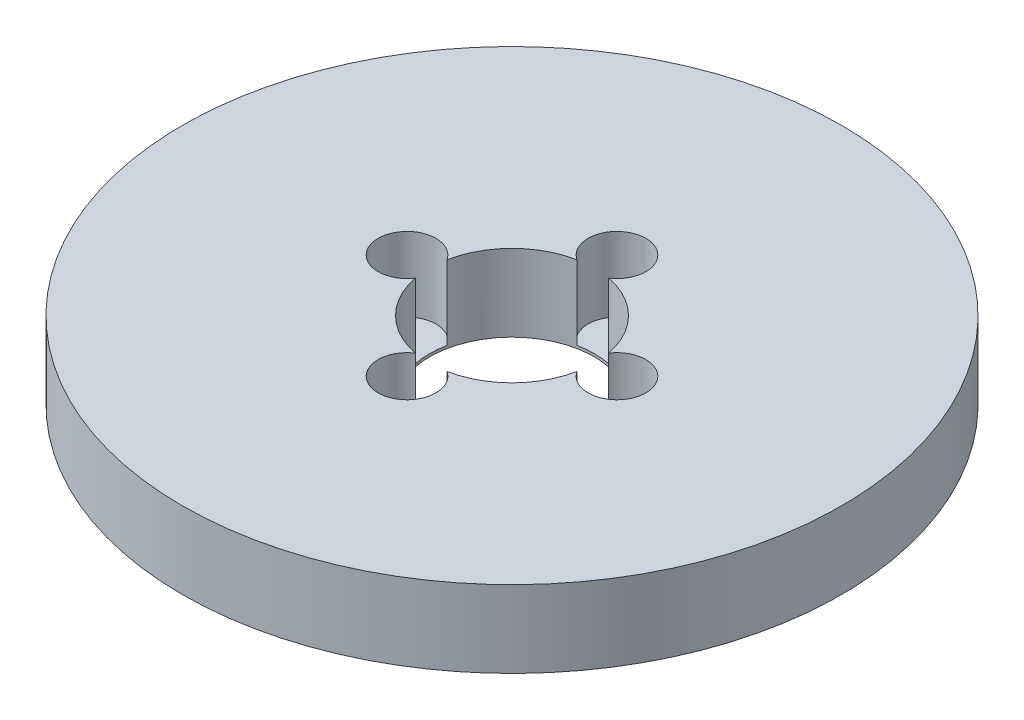
ISO-10303-21;
HEADER;
FILE_DESCRIPTION(('STEP AP214'),'2;1');
FILE_NAME('part.step','',(''),(''),'','','');
FILE_SCHEMA(('AUTOMOTIVE_DESIGN { 1 0 10303 214 1 1 1 1 }'));
ENDSEC;
DATA;
#1=APPLICATION_CONTEXT('core data for automotive mechanical design processes');
#2=APPLICATION_PROTOCOL_DEFINITION('international standard','automotive_design',2000,#1);
#3=PRODUCT_CONTEXT('',#1,'mechanical');
#4=PRODUCT('Part','Part','',(#3));
#5=PRODUCT_RELATED_PRODUCT_CATEGORY('part','',(#4));
#6=PRODUCT_DEFINITION_FORMATION('','',#4);
#7=PRODUCT_DEFINITION_CONTEXT('part definition',#1,'design');
#8=PRODUCT_DEFINITION('design','',#6,#7);
#9=PRODUCT_DEFINITION_SHAPE('','',#8);
#10=(LENGTH_UNIT() NAMED_UNIT(*) SI_UNIT(.MILLI.,.METRE.));
#11=(NAMED_UNIT(*) PLANE_ANGLE_UNIT() SI_UNIT($,.RADIAN.));
#12=(NAMED_UNIT(*) SI_UNIT($,.STERADIAN.) SOLID_ANGLE_UNIT());
#13=UNCERTAINTY_MEASURE_WITH_UNIT(LENGTH_MEASURE(1.E-05),#10,'distance_accuracy_value','');
#14=(GEOMETRIC_REPRESENTATION_CONTEXT(3) GLOBAL_UNCERTAINTY_ASSIGNED_CONTEXT((#13)) GLOBAL_UNIT_ASSIGNED_CONTEXT((#10,
#11,#12)) REPRESENTATION_CONTEXT('',''));
#15=CARTESIAN_POINT('',(0.,0.,0.));
#16=DIRECTION('',(0.,0.,1.));
#17=DIRECTION('',(1.,0.,0.));
#18=AXIS2_PLACEMENT_3D('',#15,#16,#17);
#19=CARTESIAN_POINT('',(0.,7.,0.));
#20=DIRECTION('',(0.,-1.,0.));
#21=DIRECTION('',(0.,0.,-1.));
#22=AXIS2_PLACEMENT_3D('',#19,#20,#21);
#23=CYLINDRICAL_SURFACE('',#22,30.);
#24=CARTESIAN_POINT('',(0.,7.,0.));
#25=DIRECTION('',(0.,1.,0.));
#26=DIRECTION('',(0.,0.,1.));
#27=AXIS2_PLACEMENT_3D('',#24,#25,#26);
#28=CIRCLE('',#27,30.);
#29=CARTESIAN_POINT('',(0.,7.,30.));
#30=VERTEX_POINT('',#29);
#31=EDGE_CURVE('E145',#30,#30,#28,.T.);
#32=ORIENTED_EDGE('',*,*,#31,.F.);
#33=EDGE_LOOP('',(#32));
#34=FACE_BOUND('',#33,.T.);
#35=CARTESIAN_POINT('',(0.,0.,0.));
#36=DIRECTION('',(0.,1.,0.));
#37=DIRECTION('',(0.,0.,1.));
#38=AXIS2_PLACEMENT_3D('',#35,#36,#37);
#39=CIRCLE('',#38,30.);
#40=CARTESIAN_POINT('',(0.,0.,30.));
#41=VERTEX_POINT('',#40);
#42=EDGE_CURVE('E143',#41,#41,#39,.T.);
#43=ORIENTED_EDGE('',*,*,#42,.T.);
#44=EDGE_LOOP('',(#43));
#45=FACE_BOUND('',#44,.T.);
#46=ADVANCED_FACE('F39',(#34,#45),#23,.T.);
#47=CARTESIAN_POINT('',(0.,7.,0.));
#48=DIRECTION('',(0.,1.,0.));
#49=DIRECTION('',(0.,0.,1.));
#50=AXIS2_PLACEMENT_3D('',#47,#48,#49);
#51=PLANE('',#50);
#52=CARTESIAN_POINT('',(0.,7.,9.55737214093428));
#53=DIRECTION('',(0.,1.,0.));
#54=DIRECTION('',(1.,0.,0.));
#55=AXIS2_PLACEMENT_3D('',#52,#53,#54);
#56=CIRCLE('',#55,2.62943551414392);
#57=CARTESIAN_POINT('',(-1.44371645462811,7.,7.35973388096581));
#58=VERTEX_POINT('',#57);
#59=CARTESIAN_POINT('',(1.44371645462816,7.,7.3597338809658));
#60=VERTEX_POINT('',#59);
#61=EDGE_CURVE('E152',#58,#60,#56,.T.);
#62=ORIENTED_EDGE('',*,*,#61,.F.);
#63=CARTESIAN_POINT('',(0.,7.,0.));
#64=DIRECTION('',(0.,1.,0.));
#65=DIRECTION('',(0.,0.,1.));
#66=AXIS2_PLACEMENT_3D('',#63,#64,#65);
#67=CIRCLE('',#66,7.5);
#68=CARTESIAN_POINT('',(-7.3597338809658,7.,1.44371645462813));
#69=VERTEX_POINT('',#68);
#70=EDGE_CURVE('E133',#69,#58,#67,.T.);
#71=ORIENTED_EDGE('',*,*,#70,.F.);
#72=CARTESIAN_POINT('',(-9.55737214093428,7.,0.));
#73=DIRECTION('',(0.,1.,0.));
#74=DIRECTION('',(0.,0.,1.));
#75=AXIS2_PLACEMENT_3D('',#72,#73,#74);
#76=CIRCLE('',#75,2.62943551414392);
#77=CARTESIAN_POINT('',(-7.3597338809658,7.,-1.44371645462813));
#78=VERTEX_POINT('',#77);
#79=EDGE_CURVE('E128',#78,#69,#76,.T.);
#80=ORIENTED_EDGE('',*,*,#79,.F.);
#81=CARTESIAN_POINT('',(-1.44371645462821,7.,-7.35973388096579));
#82=VERTEX_POINT('',#81);
#83=EDGE_CURVE('E121',#82,#78,#67,.T.);
#84=ORIENTED_EDGE('',*,*,#83,.F.);
#85=CARTESIAN_POINT('',(-1.00108159435354E-13,7.,-9.55737214093428));
#86=DIRECTION('',(0.,1.,0.));
#87=DIRECTION('',(-1.,0.,0.));
#88=AXIS2_PLACEMENT_3D('',#85,#86,#87);
#89=CIRCLE('',#88,2.62943551414392);
#90=CARTESIAN_POINT('',(1.44371645462806,7.,-7.35973388096582));
#91=VERTEX_POINT('',#90);
#92=EDGE_CURVE('E105',#91,#82,#89,.T.);
#93=ORIENTED_EDGE('',*,*,#92,.F.);
#94=CARTESIAN_POINT('',(7.3597338809658,7.,-1.44371645462813));
#95=VERTEX_POINT('',#94);
#96=EDGE_CURVE('E131',#95,#91,#67,.T.);
#97=ORIENTED_EDGE('',*,*,#96,.F.);
#98=CARTESIAN_POINT('',(9.55737214093428,7.,0.));
#99=DIRECTION('',(0.,1.,0.));
#100=DIRECTION('',(0.,0.,-1.));
#101=AXIS2_PLACEMENT_3D('',#98,#99,#100);
#102=CIRCLE('',#101,2.62943551414392);
#103=CARTESIAN_POINT('',(7.3597338809658,7.,1.44371645462813));
#104=VERTEX_POINT('',#103);
#105=EDGE_CURVE('E154',#104,#95,#102,.T.);
#106=ORIENTED_EDGE('',*,*,#105,.F.);
#107=EDGE_CURVE('E134',#60,#104,#67,.T.);
#108=ORIENTED_EDGE('',*,*,#107,.F.);
#109=EDGE_LOOP('',(#62,#71,#80,#84,#93,#97,#106,#108));
#110=FACE_BOUND('',#109,.T.);
#111=ORIENTED_EDGE('',*,*,#31,.T.);
#112=EDGE_LOOP('',(#111));
#113=FACE_BOUND('',#112,.T.);
#114=ADVANCED_FACE('F130',(#110,#113),#51,.T.);
#115=CARTESIAN_POINT('',(0.,0.,0.));
#116=DIRECTION('',(0.,1.,0.));
#117=DIRECTION('',(0.,0.,1.));
#118=AXIS2_PLACEMENT_3D('',#115,#116,#117);
#119=PLANE('',#118);
#120=CARTESIAN_POINT('',(0.,0.,0.));
#121=DIRECTION('',(0.,1.,0.));
#122=DIRECTION('',(0.,0.,1.));
#123=AXIS2_PLACEMENT_3D('',#120,#121,#122);
#124=CIRCLE('',#123,7.5);
#125=CARTESIAN_POINT('',(0.,0.,7.5));
#126=VERTEX_POINT('',#125);
#127=EDGE_CURVE('E135',#126,#126,#124,.T.);
#128=ORIENTED_EDGE('',*,*,#127,.T.);
#129=EDGE_LOOP('',(#128));
#130=FACE_BOUND('',#129,.T.);
#131=ORIENTED_EDGE('',*,*,#42,.F.);
#132=EDGE_LOOP('',(#131));
#133=FACE_BOUND('',#132,.T.);
#134=ADVANCED_FACE('F195',(#130,#133),#119,.F.);
#135=CARTESIAN_POINT('',(0.,7.,0.));
#136=DIRECTION('',(0.,-1.,0.));
#137=DIRECTION('',(0.,0.,-1.));
#138=AXIS2_PLACEMENT_3D('',#135,#136,#137);
#139=CYLINDRICAL_SURFACE('',#138,7.5);
#140=DIRECTION('',(0.,1.,0.));
#141=VECTOR('',#140,1.);
#142=CARTESIAN_POINT('',(-1.44371645462811,3.62401441227768,7.35973388096581));
#143=LINE('',#142,#141);
#144=CARTESIAN_POINT('',(-1.44371645462811,0.248028824555362,7.35973388096581));
#145=VERTEX_POINT('',#144);
#146=EDGE_CURVE('E11',#145,#58,#143,.T.);
#147=ORIENTED_EDGE('',*,*,#146,.F.);
#148=CARTESIAN_POINT('',(0.,0.248028824555362,0.));
#149=DIRECTION('',(0.,1.,0.));
#150=DIRECTION('',(0.,0.,1.));
#151=AXIS2_PLACEMENT_3D('',#148,#149,#150);
#152=CIRCLE('',#151,7.5);
#153=CARTESIAN_POINT('',(1.44371645462816,0.248028824555362,7.3597338809658));
#154=VERTEX_POINT('',#153);
#155=EDGE_CURVE('E169',#145,#154,#152,.T.);
#156=ORIENTED_EDGE('',*,*,#155,.T.);
#157=DIRECTION('',(0.,1.,0.));
#158=VECTOR('',#157,1.);
#159=CARTESIAN_POINT('',(1.44371645462816,3.62401441227768,7.3597338809658));
#160=LINE('',#159,#158);
#161=EDGE_CURVE('E46',#60,#154,#160,.F.);
#162=ORIENTED_EDGE('',*,*,#161,.F.);
#163=ORIENTED_EDGE('',*,*,#107,.T.);
#164=DIRECTION('',(0.,1.,0.));
#165=VECTOR('',#164,1.);
#166=CARTESIAN_POINT('',(7.3597338809658,3.62401441227768,1.44371645462814));
#167=LINE('',#166,#165);
#168=CARTESIAN_POINT('',(7.3597338809658,0.248028824555362,1.44371645462813));
#169=VERTEX_POINT('',#168);
#170=EDGE_CURVE('E151',#169,#104,#167,.T.);
#171=ORIENTED_EDGE('',*,*,#170,.F.);
#172=CARTESIAN_POINT('',(0.,0.248028824555362,0.));
#173=DIRECTION('',(0.,1.,0.));
#174=DIRECTION('',(0.,0.,1.));
#175=AXIS2_PLACEMENT_3D('',#172,#173,#174);
#176=CIRCLE('',#175,7.5);
#177=CARTESIAN_POINT('',(7.3597338809658,0.248028824555362,-1.44371645462813));
#178=VERTEX_POINT('',#177);
#179=EDGE_CURVE('E173',#169,#178,#176,.T.);
#180=ORIENTED_EDGE('',*,*,#179,.T.);
#181=DIRECTION('',(0.,1.,0.));
#182=VECTOR('',#181,1.);
#183=CARTESIAN_POINT('',(7.3597338809658,3.62401441227768,-1.44371645462814));
#184=LINE('',#183,#182);
#185=EDGE_CURVE('E168',#95,#178,#184,.F.);
#186=ORIENTED_EDGE('',*,*,#185,.F.);
#187=ORIENTED_EDGE('',*,*,#96,.T.);
#188=DIRECTION('',(0.,1.,0.));
#189=VECTOR('',#188,1.);
#190=CARTESIAN_POINT('',(1.44371645462806,3.62401441227768,-7.35973388096582));
#191=LINE('',#190,#189);
#192=CARTESIAN_POINT('',(1.44371645462806,0.248028824555362,-7.35973388096582));
#193=VERTEX_POINT('',#192);
#194=EDGE_CURVE('E108',#193,#91,#191,.T.);
#195=ORIENTED_EDGE('',*,*,#194,.F.);
#196=CARTESIAN_POINT('',(0.,0.248028824555362,0.));
#197=DIRECTION('',(0.,1.,0.));
#198=DIRECTION('',(0.,0.,1.));
#199=AXIS2_PLACEMENT_3D('',#196,#197,#198);
#200=CIRCLE('',#199,7.5);
#201=CARTESIAN_POINT('',(-1.44371645462821,0.248028824555362,-7.35973388096579));
#202=VERTEX_POINT('',#201);
#203=EDGE_CURVE('E122',#193,#202,#200,.T.);
#204=ORIENTED_EDGE('',*,*,#203,.T.);
#205=DIRECTION('',(0.,1.,0.));
#206=VECTOR('',#205,1.);
#207=CARTESIAN_POINT('',(-1.44371645462821,3.62401441227768,-7.35973388096579));
#208=LINE('',#207,#206);
#209=EDGE_CURVE('E106',#82,#202,#208,.F.);
#210=ORIENTED_EDGE('',*,*,#209,.F.);
#211=ORIENTED_EDGE('',*,*,#83,.T.);
#212=DIRECTION('',(0.,1.,0.));
#213=VECTOR('',#212,1.);
#214=CARTESIAN_POINT('',(-7.3597338809658,3.62401441227768,-1.44371645462814));
#215=LINE('',#214,#213);
#216=CARTESIAN_POINT('',(-7.3597338809658,0.248028824555362,-1.44371645462813));
#217=VERTEX_POINT('',#216);
#218=EDGE_CURVE('E177',#217,#78,#215,.T.);
#219=ORIENTED_EDGE('',*,*,#218,.F.);
#220=CARTESIAN_POINT('',(0.,0.248028824555362,0.));
#221=DIRECTION('',(0.,1.,0.));
#222=DIRECTION('',(0.,0.,1.));
#223=AXIS2_PLACEMENT_3D('',#220,#221,#222);
#224=CIRCLE('',#223,7.5);
#225=CARTESIAN_POINT('',(-7.3597338809658,0.248028824555362,1.44371645462813));
#226=VERTEX_POINT('',#225);
#227=EDGE_CURVE('E185',#217,#226,#224,.T.);
#228=ORIENTED_EDGE('',*,*,#227,.T.);
#229=DIRECTION('',(0.,1.,0.));
#230=VECTOR('',#229,1.);
#231=CARTESIAN_POINT('',(-7.3597338809658,3.62401441227768,1.44371645462814));
#232=LINE('',#231,#230);
#233=EDGE_CURVE('E179',#69,#226,#232,.F.);
#234=ORIENTED_EDGE('',*,*,#233,.F.);
#235=ORIENTED_EDGE('',*,*,#70,.T.);
#236=EDGE_LOOP('',(#147,#156,#162,#163,#171,#180,#186,#187,#195,#204,#210,#211,#219,#228,#234,#235));
#237=FACE_BOUND('',#236,.T.);
#238=ORIENTED_EDGE('',*,*,#127,.F.);
#239=EDGE_LOOP('',(#238));
#240=FACE_BOUND('',#239,.T.);
#241=ADVANCED_FACE('F117',(#237,#240),#139,.F.);
#242=CARTESIAN_POINT('',(-9.55737214093428,0.248028824555362,0.));
#243=DIRECTION('',(0.,1.,0.));
#244=DIRECTION('',(0.,0.,1.));
#245=AXIS2_PLACEMENT_3D('',#242,#243,#244);
#246=CYLINDRICAL_SURFACE('',#245,2.62943551414392);
#247=ORIENTED_EDGE('',*,*,#218,.T.);
#248=ORIENTED_EDGE('',*,*,#79,.T.);
#249=ORIENTED_EDGE('',*,*,#233,.T.);
#250=CARTESIAN_POINT('',(-9.55737214093428,0.248028824555362,0.));
#251=DIRECTION('',(0.,1.,0.));
#252=DIRECTION('',(0.,0.,1.));
#253=AXIS2_PLACEMENT_3D('',#250,#251,#252);
#254=CIRCLE('',#253,2.62943551414392);
#255=EDGE_CURVE('E140',#217,#226,#254,.T.);
#256=ORIENTED_EDGE('',*,*,#255,.F.);
#257=EDGE_LOOP('',(#247,#248,#249,#256));
#258=FACE_BOUND('',#257,.T.);
#259=ADVANCED_FACE('F200',(#258),#246,.F.);
#260=CARTESIAN_POINT('',(-9.55737214093428,0.248028824555362,0.));
#261=DIRECTION('',(0.,1.,0.));
#262=DIRECTION('',(0.,0.,1.));
#263=AXIS2_PLACEMENT_3D('',#260,#261,#262);
#264=PLANE('',#263);
#265=ORIENTED_EDGE('',*,*,#255,.T.);
#266=ORIENTED_EDGE('',*,*,#227,.F.);
#267=EDGE_LOOP('',(#265,#266));
#268=FACE_BOUND('',#267,.T.);
#269=ADVANCED_FACE('F202',(#268),#264,.T.);
#270=CARTESIAN_POINT('',(-1.00108159435354E-13,0.248028824555362,-9.55737214093428));
#271=DIRECTION('',(0.,1.,0.));
#272=DIRECTION('',(0.,0.,1.));
#273=AXIS2_PLACEMENT_3D('',#270,#271,#272);
#274=CYLINDRICAL_SURFACE('',#273,2.62943551414392);
#275=ORIENTED_EDGE('',*,*,#194,.T.);
#276=ORIENTED_EDGE('',*,*,#92,.T.);
#277=ORIENTED_EDGE('',*,*,#209,.T.);
#278=CARTESIAN_POINT('',(-1.00108159435354E-13,0.248028824555362,-9.55737214093428));
#279=DIRECTION('',(0.,1.,0.));
#280=DIRECTION('',(-1.,0.,0.));
#281=AXIS2_PLACEMENT_3D('',#278,#279,#280);
#282=CIRCLE('',#281,2.62943551414392);
#283=EDGE_CURVE('E111',#193,#202,#282,.T.);
#284=ORIENTED_EDGE('',*,*,#283,.F.);
#285=EDGE_LOOP('',(#275,#276,#277,#284));
#286=FACE_BOUND('',#285,.T.);
#287=ADVANCED_FACE('F102',(#286),#274,.F.);
#288=CARTESIAN_POINT('',(-1.00108159435354E-13,0.248028824555362,-9.55737214093428));
#289=DIRECTION('',(0.,1.,0.));
#290=DIRECTION('',(-1.,0.,0.));
#291=AXIS2_PLACEMENT_3D('',#288,#289,#290);
#292=PLANE('',#291);
#293=ORIENTED_EDGE('',*,*,#283,.T.);
#294=ORIENTED_EDGE('',*,*,#203,.F.);
#295=EDGE_LOOP('',(#293,#294));
#296=FACE_BOUND('',#295,.T.);
#297=ADVANCED_FACE('F211',(#296),#292,.T.);
#298=CARTESIAN_POINT('',(9.55737214093428,0.248028824555362,0.));
#299=DIRECTION('',(0.,1.,0.));
#300=DIRECTION('',(0.,0.,1.));
#301=AXIS2_PLACEMENT_3D('',#298,#299,#300);
#302=CYLINDRICAL_SURFACE('',#301,2.62943551414392);
#303=ORIENTED_EDGE('',*,*,#170,.T.);
#304=ORIENTED_EDGE('',*,*,#105,.T.);
#305=ORIENTED_EDGE('',*,*,#185,.T.);
#306=CARTESIAN_POINT('',(9.55737214093428,0.248028824555362,0.));
#307=DIRECTION('',(0.,1.,0.));
#308=DIRECTION('',(0.,0.,-1.));
#309=AXIS2_PLACEMENT_3D('',#306,#307,#308);
#310=CIRCLE('',#309,2.62943551414392);
#311=EDGE_CURVE('E56',#169,#178,#310,.T.);
#312=ORIENTED_EDGE('',*,*,#311,.F.);
#313=EDGE_LOOP('',(#303,#304,#305,#312));
#314=FACE_BOUND('',#313,.T.);
#315=ADVANCED_FACE('F212',(#314),#302,.F.);
#316=CARTESIAN_POINT('',(9.55737214093428,0.248028824555362,0.));
#317=DIRECTION('',(0.,1.,0.));
#318=DIRECTION('',(0.,0.,-1.));
#319=AXIS2_PLACEMENT_3D('',#316,#317,#318);
#320=PLANE('',#319);
#321=ORIENTED_EDGE('',*,*,#311,.T.);
#322=ORIENTED_EDGE('',*,*,#179,.F.);
#323=EDGE_LOOP('',(#321,#322));
#324=FACE_BOUND('',#323,.T.);
#325=ADVANCED_FACE('F217',(#324),#320,.T.);
#326=CARTESIAN_POINT('',(0.,0.248028824555362,9.55737214093428));
#327=DIRECTION('',(0.,1.,0.));
#328=DIRECTION('',(0.,0.,1.));
#329=AXIS2_PLACEMENT_3D('',#326,#327,#328);
#330=CYLINDRICAL_SURFACE('',#329,2.62943551414392);
#331=ORIENTED_EDGE('',*,*,#146,.T.);
#332=ORIENTED_EDGE('',*,*,#61,.T.);
#333=ORIENTED_EDGE('',*,*,#161,.T.);
#334=CARTESIAN_POINT('',(0.,0.248028824555362,9.55737214093428));
#335=DIRECTION('',(0.,1.,0.));
#336=DIRECTION('',(1.,0.,0.));
#337=AXIS2_PLACEMENT_3D('',#334,#335,#336);
#338=CIRCLE('',#337,2.62943551414392);
#339=EDGE_CURVE('E55',#145,#154,#338,.T.);
#340=ORIENTED_EDGE('',*,*,#339,.F.);
#341=EDGE_LOOP('',(#331,#332,#333,#340));
#342=FACE_BOUND('',#341,.T.);
#343=ADVANCED_FACE('F170',(#342),#330,.F.);
#344=CARTESIAN_POINT('',(0.,0.248028824555362,9.55737214093428));
#345=DIRECTION('',(0.,1.,0.));
#346=DIRECTION('',(1.,0.,0.));
#347=AXIS2_PLACEMENT_3D('',#344,#345,#346);
#348=PLANE('',#347);
#349=ORIENTED_EDGE('',*,*,#339,.T.);
#350=ORIENTED_EDGE('',*,*,#155,.F.);
#351=EDGE_LOOP('',(#349,#350));
#352=FACE_BOUND('',#351,.T.);
#353=ADVANCED_FACE('F224',(#352),#348,.T.);
#354=CLOSED_SHELL('',(#46,#114,#134,#241,#259,#269,#287,#297,#315,#325,#343,#353));
#355=MANIFOLD_SOLID_BREP('B2',#354);
#356=ADVANCED_BREP_SHAPE_REPRESENTATION('',(#18,#355),#14);
#357=SHAPE_DEFINITION_REPRESENTATION(#9,#356);
ENDSEC;
END-ISO-10303-21;
